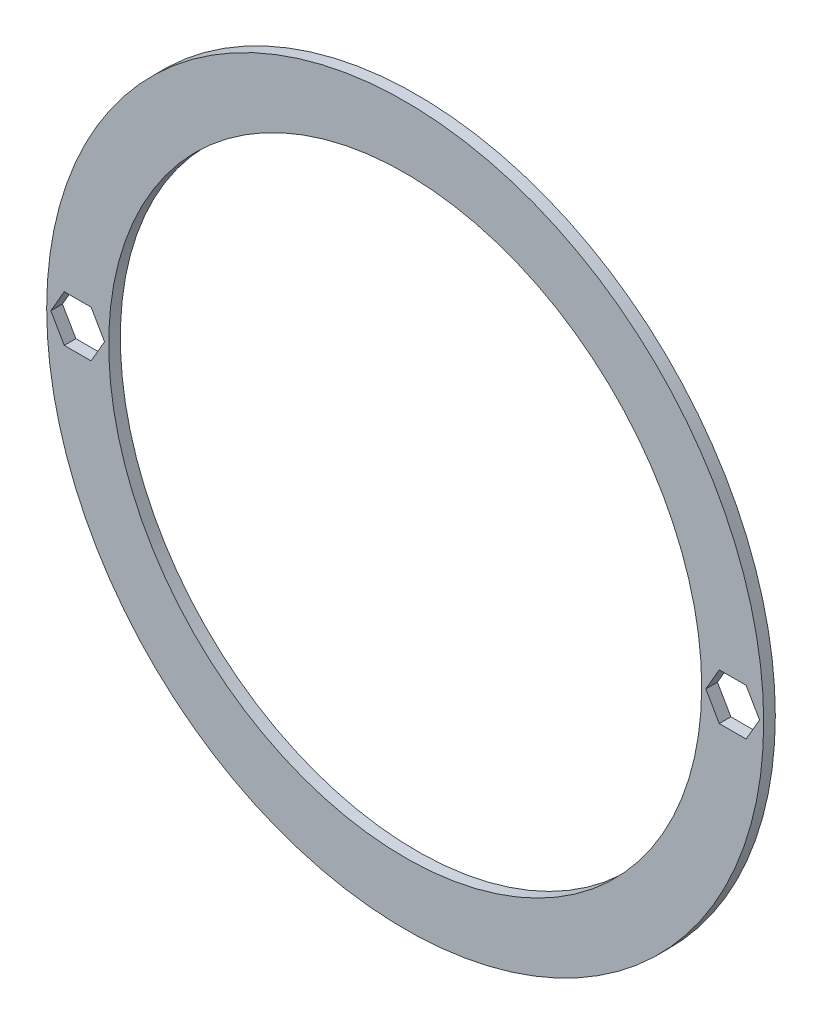
ISO-10303-21;
HEADER;
FILE_DESCRIPTION(('STEP AP214'),'2;1');
FILE_NAME('part.step','',(''),(''),'','','');
FILE_SCHEMA(('AUTOMOTIVE_DESIGN { 1 0 10303 214 1 1 1 1 }'));
ENDSEC;
DATA;
#1=APPLICATION_CONTEXT('core data for automotive mechanical design processes');
#2=APPLICATION_PROTOCOL_DEFINITION('international standard','automotive_design',2000,#1);
#3=PRODUCT_CONTEXT('',#1,'mechanical');
#4=PRODUCT('Part','Part','',(#3));
#5=PRODUCT_RELATED_PRODUCT_CATEGORY('part','',(#4));
#6=PRODUCT_DEFINITION_FORMATION('','',#4);
#7=PRODUCT_DEFINITION_CONTEXT('part definition',#1,'design');
#8=PRODUCT_DEFINITION('design','',#6,#7);
#9=PRODUCT_DEFINITION_SHAPE('','',#8);
#10=(LENGTH_UNIT() NAMED_UNIT(*) SI_UNIT(.MILLI.,.METRE.));
#11=(NAMED_UNIT(*) PLANE_ANGLE_UNIT() SI_UNIT($,.RADIAN.));
#12=(NAMED_UNIT(*) SI_UNIT($,.STERADIAN.) SOLID_ANGLE_UNIT());
#13=UNCERTAINTY_MEASURE_WITH_UNIT(LENGTH_MEASURE(1.E-05),#10,'distance_accuracy_value','');
#14=(GEOMETRIC_REPRESENTATION_CONTEXT(3) GLOBAL_UNCERTAINTY_ASSIGNED_CONTEXT((#13)) GLOBAL_UNIT_ASSIGNED_CONTEXT((#10,
#11,#12)) REPRESENTATION_CONTEXT('',''));
#15=CARTESIAN_POINT('',(0.,0.,0.));
#16=DIRECTION('',(0.,0.,1.));
#17=DIRECTION('',(1.,0.,0.));
#18=AXIS2_PLACEMENT_3D('',#15,#16,#17);
#19=CARTESIAN_POINT('',(0.,0.,1.5));
#20=DIRECTION('',(0.,0.,1.));
#21=DIRECTION('',(1.,0.,0.));
#22=AXIS2_PLACEMENT_3D('',#19,#20,#21);
#23=PLANE('',#22);
#24=CARTESIAN_POINT('',(0.,0.,1.5));
#25=DIRECTION('',(0.,0.,1.));
#26=DIRECTION('',(1.,0.,0.));
#27=AXIS2_PLACEMENT_3D('',#24,#25,#26);
#28=CIRCLE('',#27,46.25);
#29=CARTESIAN_POINT('',(46.25,0.,1.5));
#30=VERTEX_POINT('',#29);
#31=EDGE_CURVE('E11',#30,#30,#28,.T.);
#32=ORIENTED_EDGE('',*,*,#31,.T.);
#33=EDGE_LOOP('',(#32));
#34=FACE_BOUND('',#33,.T.);
#35=CARTESIAN_POINT('',(0.,0.,1.5));
#36=DIRECTION('',(0.,0.,1.));
#37=DIRECTION('',(1.,0.,0.));
#38=AXIS2_PLACEMENT_3D('',#35,#36,#37);
#39=CIRCLE('',#38,38.25);
#40=CARTESIAN_POINT('',(38.25,0.,1.5));
#41=VERTEX_POINT('',#40);
#42=EDGE_CURVE('E265',#41,#41,#39,.T.);
#43=ORIENTED_EDGE('',*,*,#42,.F.);
#44=EDGE_LOOP('',(#43));
#45=FACE_BOUND('',#44,.T.);
#46=DIRECTION('',(1.,0.,0.));
#47=VECTOR('',#46,1.);
#48=CARTESIAN_POINT('',(43.9820508075689,-3.,1.5));
#49=LINE('',#48,#47);
#50=CARTESIAN_POINT('',(40.5179491924311,-3.,1.5));
#51=VERTEX_POINT('',#50);
#52=CARTESIAN_POINT('',(43.9820508075689,-3.,1.5));
#53=VERTEX_POINT('',#52);
#54=EDGE_CURVE('E205',#51,#53,#49,.T.);
#55=ORIENTED_EDGE('',*,*,#54,.F.);
#56=DIRECTION('',(0.5,-0.866025403784439,0.));
#57=VECTOR('',#56,1.);
#58=CARTESIAN_POINT('',(40.5179491924311,-3.,1.5));
#59=LINE('',#58,#57);
#60=CARTESIAN_POINT('',(38.7858983848622,0.,1.5));
#61=VERTEX_POINT('',#60);
#62=EDGE_CURVE('E202',#61,#51,#59,.T.);
#63=ORIENTED_EDGE('',*,*,#62,.F.);
#64=DIRECTION('',(-0.500000000000001,-0.866025403784438,0.));
#65=VECTOR('',#64,1.);
#66=CARTESIAN_POINT('',(38.7858983848622,0.,1.5));
#67=LINE('',#66,#65);
#68=CARTESIAN_POINT('',(40.5179491924311,2.99999999999999,1.5));
#69=VERTEX_POINT('',#68);
#70=EDGE_CURVE('E219',#69,#61,#67,.T.);
#71=ORIENTED_EDGE('',*,*,#70,.F.);
#72=DIRECTION('',(-1.,0.,0.));
#73=VECTOR('',#72,1.);
#74=CARTESIAN_POINT('',(40.5179491924311,3.,1.5));
#75=LINE('',#74,#73);
#76=CARTESIAN_POINT('',(43.9820508075689,3.,1.5));
#77=VERTEX_POINT('',#76);
#78=EDGE_CURVE('E215',#77,#69,#75,.T.);
#79=ORIENTED_EDGE('',*,*,#78,.F.);
#80=DIRECTION('',(-0.5,0.866025403784439,0.));
#81=VECTOR('',#80,1.);
#82=CARTESIAN_POINT('',(43.9820508075689,3.,1.5));
#83=LINE('',#82,#81);
#84=CARTESIAN_POINT('',(45.7141016151377,0.,1.5));
#85=VERTEX_POINT('',#84);
#86=EDGE_CURVE('E212',#85,#77,#83,.T.);
#87=ORIENTED_EDGE('',*,*,#86,.F.);
#88=DIRECTION('',(0.5,0.866025403784439,0.));
#89=VECTOR('',#88,1.);
#90=CARTESIAN_POINT('',(45.7141016151377,0.,1.5));
#91=LINE('',#90,#89);
#92=EDGE_CURVE('E209',#53,#85,#91,.T.);
#93=ORIENTED_EDGE('',*,*,#92,.F.);
#94=EDGE_LOOP('',(#55,#63,#71,#79,#87,#93));
#95=FACE_BOUND('',#94,.T.);
#96=DIRECTION('',(-1.,0.,0.));
#97=VECTOR('',#96,1.);
#98=CARTESIAN_POINT('',(-40.5179491924311,3.,1.5));
#99=LINE('',#98,#97);
#100=CARTESIAN_POINT('',(-40.5179491924311,3.,1.5));
#101=VERTEX_POINT('',#100);
#102=CARTESIAN_POINT('',(-43.9820508075689,3.,1.5));
#103=VERTEX_POINT('',#102);
#104=EDGE_CURVE('E142',#101,#103,#99,.T.);
#105=ORIENTED_EDGE('',*,*,#104,.F.);
#106=DIRECTION('',(-0.500000000000001,0.866025403784438,0.));
#107=VECTOR('',#106,1.);
#108=CARTESIAN_POINT('',(-38.7858983848622,0.,1.5));
#109=LINE('',#108,#107);
#110=CARTESIAN_POINT('',(-38.7858983848622,0.,1.5));
#111=VERTEX_POINT('',#110);
#112=EDGE_CURVE('E133',#111,#101,#109,.T.);
#113=ORIENTED_EDGE('',*,*,#112,.F.);
#114=DIRECTION('',(0.5,0.866025403784439,0.));
#115=VECTOR('',#114,1.);
#116=CARTESIAN_POINT('',(-40.5179491924311,-3.,1.5));
#117=LINE('',#116,#115);
#118=CARTESIAN_POINT('',(-40.5179491924311,-3.,1.5));
#119=VERTEX_POINT('',#118);
#120=EDGE_CURVE('E168',#119,#111,#117,.T.);
#121=ORIENTED_EDGE('',*,*,#120,.F.);
#122=DIRECTION('',(1.,0.,0.));
#123=VECTOR('',#122,1.);
#124=CARTESIAN_POINT('',(-43.9820508075689,-3.,1.5));
#125=LINE('',#124,#123);
#126=CARTESIAN_POINT('',(-43.9820508075689,-3.,1.5));
#127=VERTEX_POINT('',#126);
#128=EDGE_CURVE('E165',#127,#119,#125,.T.);
#129=ORIENTED_EDGE('',*,*,#128,.F.);
#130=DIRECTION('',(0.5,-0.866025403784439,0.));
#131=VECTOR('',#130,1.);
#132=CARTESIAN_POINT('',(-45.7141016151377,0.,1.5));
#133=LINE('',#132,#131);
#134=CARTESIAN_POINT('',(-45.7141016151377,0.,1.5));
#135=VERTEX_POINT('',#134);
#136=EDGE_CURVE('E160',#135,#127,#133,.T.);
#137=ORIENTED_EDGE('',*,*,#136,.F.);
#138=DIRECTION('',(-0.5,-0.866025403784439,0.));
#139=VECTOR('',#138,1.);
#140=CARTESIAN_POINT('',(-43.9820508075689,3.,1.5));
#141=LINE('',#140,#139);
#142=EDGE_CURVE('E156',#103,#135,#141,.T.);
#143=ORIENTED_EDGE('',*,*,#142,.F.);
#144=EDGE_LOOP('',(#105,#113,#121,#129,#137,#143));
#145=FACE_BOUND('',#144,.T.);
#146=ADVANCED_FACE('F43',(#34,#45,#95,#145),#23,.T.);
#147=CARTESIAN_POINT('',(0.,0.,0.));
#148=DIRECTION('',(0.,0.,1.));
#149=DIRECTION('',(1.,0.,0.));
#150=AXIS2_PLACEMENT_3D('',#147,#148,#149);
#151=PLANE('',#150);
#152=DIRECTION('',(0.5,-0.866025403784439,0.));
#153=VECTOR('',#152,1.);
#154=CARTESIAN_POINT('',(40.5179491924311,-3.,0.));
#155=LINE('',#154,#153);
#156=CARTESIAN_POINT('',(38.7858983848623,0.,0.));
#157=VERTEX_POINT('',#156);
#158=CARTESIAN_POINT('',(40.5179491924311,-3.,0.));
#159=VERTEX_POINT('',#158);
#160=EDGE_CURVE('E151',#157,#159,#155,.T.);
#161=ORIENTED_EDGE('',*,*,#160,.T.);
#162=DIRECTION('',(1.,0.,0.));
#163=VECTOR('',#162,1.);
#164=CARTESIAN_POINT('',(43.9820508075689,-3.,0.));
#165=LINE('',#164,#163);
#166=CARTESIAN_POINT('',(43.9820508075689,-3.,0.));
#167=VERTEX_POINT('',#166);
#168=EDGE_CURVE('E226',#159,#167,#165,.T.);
#169=ORIENTED_EDGE('',*,*,#168,.T.);
#170=DIRECTION('',(0.5,0.866025403784439,0.));
#171=VECTOR('',#170,1.);
#172=CARTESIAN_POINT('',(45.7141016151377,0.,0.));
#173=LINE('',#172,#171);
#174=CARTESIAN_POINT('',(45.7141016151377,0.,0.));
#175=VERTEX_POINT('',#174);
#176=EDGE_CURVE('E230',#167,#175,#173,.T.);
#177=ORIENTED_EDGE('',*,*,#176,.T.);
#178=DIRECTION('',(-0.5,0.866025403784439,0.));
#179=VECTOR('',#178,1.);
#180=CARTESIAN_POINT('',(43.9820508075689,3.,0.));
#181=LINE('',#180,#179);
#182=CARTESIAN_POINT('',(43.9820508075689,3.,0.));
#183=VERTEX_POINT('',#182);
#184=EDGE_CURVE('E234',#175,#183,#181,.T.);
#185=ORIENTED_EDGE('',*,*,#184,.T.);
#186=DIRECTION('',(-1.,0.,0.));
#187=VECTOR('',#186,1.);
#188=CARTESIAN_POINT('',(40.5179491924311,3.,0.));
#189=LINE('',#188,#187);
#190=CARTESIAN_POINT('',(40.5179491924311,3.,0.));
#191=VERTEX_POINT('',#190);
#192=EDGE_CURVE('E238',#183,#191,#189,.T.);
#193=ORIENTED_EDGE('',*,*,#192,.T.);
#194=DIRECTION('',(-0.500000000000001,-0.866025403784438,0.));
#195=VECTOR('',#194,1.);
#196=CARTESIAN_POINT('',(38.7858983848622,0.,0.));
#197=LINE('',#196,#195);
#198=EDGE_CURVE('E206',#191,#157,#197,.T.);
#199=ORIENTED_EDGE('',*,*,#198,.T.);
#200=EDGE_LOOP('',(#161,#169,#177,#185,#193,#199));
#201=FACE_BOUND('',#200,.T.);
#202=CARTESIAN_POINT('',(0.,0.,0.));
#203=DIRECTION('',(0.,0.,1.));
#204=DIRECTION('',(1.,0.,0.));
#205=AXIS2_PLACEMENT_3D('',#202,#203,#204);
#206=CIRCLE('',#205,46.25);
#207=CARTESIAN_POINT('',(46.25,0.,0.));
#208=VERTEX_POINT('',#207);
#209=EDGE_CURVE('E47',#208,#208,#206,.T.);
#210=ORIENTED_EDGE('',*,*,#209,.F.);
#211=EDGE_LOOP('',(#210));
#212=FACE_BOUND('',#211,.T.);
#213=CARTESIAN_POINT('',(0.,0.,0.));
#214=DIRECTION('',(0.,0.,1.));
#215=DIRECTION('',(1.,0.,0.));
#216=AXIS2_PLACEMENT_3D('',#213,#214,#215);
#217=CIRCLE('',#216,38.25);
#218=CARTESIAN_POINT('',(38.25,0.,0.));
#219=VERTEX_POINT('',#218);
#220=EDGE_CURVE('E264',#219,#219,#217,.T.);
#221=ORIENTED_EDGE('',*,*,#220,.T.);
#222=EDGE_LOOP('',(#221));
#223=FACE_BOUND('',#222,.T.);
#224=DIRECTION('',(-0.500000000000001,0.866025403784438,0.));
#225=VECTOR('',#224,1.);
#226=CARTESIAN_POINT('',(-38.7858983848622,0.,0.));
#227=LINE('',#226,#225);
#228=CARTESIAN_POINT('',(-38.7858983848622,0.,0.));
#229=VERTEX_POINT('',#228);
#230=CARTESIAN_POINT('',(-40.5179491924311,3.,0.));
#231=VERTEX_POINT('',#230);
#232=EDGE_CURVE('E67',#229,#231,#227,.T.);
#233=ORIENTED_EDGE('',*,*,#232,.T.);
#234=DIRECTION('',(-1.,0.,0.));
#235=VECTOR('',#234,1.);
#236=CARTESIAN_POINT('',(-40.5179491924311,3.,0.));
#237=LINE('',#236,#235);
#238=CARTESIAN_POINT('',(-43.9820508075689,3.,0.));
#239=VERTEX_POINT('',#238);
#240=EDGE_CURVE('E149',#231,#239,#237,.T.);
#241=ORIENTED_EDGE('',*,*,#240,.T.);
#242=DIRECTION('',(-0.5,-0.866025403784439,0.));
#243=VECTOR('',#242,1.);
#244=CARTESIAN_POINT('',(-43.9820508075689,3.,0.));
#245=LINE('',#244,#243);
#246=CARTESIAN_POINT('',(-45.7141016151377,0.,0.));
#247=VERTEX_POINT('',#246);
#248=EDGE_CURVE('E175',#239,#247,#245,.T.);
#249=ORIENTED_EDGE('',*,*,#248,.T.);
#250=DIRECTION('',(0.5,-0.866025403784439,0.));
#251=VECTOR('',#250,1.);
#252=CARTESIAN_POINT('',(-45.7141016151377,0.,0.));
#253=LINE('',#252,#251);
#254=CARTESIAN_POINT('',(-43.9820508075689,-3.,0.));
#255=VERTEX_POINT('',#254);
#256=EDGE_CURVE('E179',#247,#255,#253,.T.);
#257=ORIENTED_EDGE('',*,*,#256,.T.);
#258=DIRECTION('',(1.,0.,0.));
#259=VECTOR('',#258,1.);
#260=CARTESIAN_POINT('',(-43.9820508075689,-3.,0.));
#261=LINE('',#260,#259);
#262=CARTESIAN_POINT('',(-40.5179491924311,-3.,0.));
#263=VERTEX_POINT('',#262);
#264=EDGE_CURVE('E183',#255,#263,#261,.T.);
#265=ORIENTED_EDGE('',*,*,#264,.T.);
#266=DIRECTION('',(0.5,0.866025403784439,0.));
#267=VECTOR('',#266,1.);
#268=CARTESIAN_POINT('',(-40.5179491924311,-3.,0.));
#269=LINE('',#268,#267);
#270=EDGE_CURVE('E143',#263,#229,#269,.T.);
#271=ORIENTED_EDGE('',*,*,#270,.T.);
#272=EDGE_LOOP('',(#233,#241,#249,#257,#265,#271));
#273=FACE_BOUND('',#272,.T.);
#274=ADVANCED_FACE('F273',(#201,#212,#223,#273),#151,.F.);
#275=CARTESIAN_POINT('',(0.,0.,1.5));
#276=DIRECTION('',(0.,0.,-1.));
#277=DIRECTION('',(-1.,0.,0.));
#278=AXIS2_PLACEMENT_3D('',#275,#276,#277);
#279=CYLINDRICAL_SURFACE('',#278,46.25);
#280=ORIENTED_EDGE('',*,*,#31,.F.);
#281=EDGE_LOOP('',(#280));
#282=FACE_BOUND('',#281,.T.);
#283=ORIENTED_EDGE('',*,*,#209,.T.);
#284=EDGE_LOOP('',(#283));
#285=FACE_BOUND('',#284,.T.);
#286=ADVANCED_FACE('F45',(#282,#285),#279,.T.);
#287=CARTESIAN_POINT('',(0.,0.,1.5));
#288=DIRECTION('',(0.,0.,-1.));
#289=DIRECTION('',(-1.,0.,0.));
#290=AXIS2_PLACEMENT_3D('',#287,#288,#289);
#291=CYLINDRICAL_SURFACE('',#290,38.25);
#292=ORIENTED_EDGE('',*,*,#42,.T.);
#293=EDGE_LOOP('',(#292));
#294=FACE_BOUND('',#293,.T.);
#295=ORIENTED_EDGE('',*,*,#220,.F.);
#296=EDGE_LOOP('',(#295));
#297=FACE_BOUND('',#296,.T.);
#298=ADVANCED_FACE('F276',(#294,#297),#291,.F.);
#299=CARTESIAN_POINT('',(40.5179491924311,-3.,1.5));
#300=DIRECTION('',(0.866025403784439,0.5,0.));
#301=DIRECTION('',(-0.5,0.866025403784439,0.));
#302=AXIS2_PLACEMENT_3D('',#299,#300,#301);
#303=PLANE('',#302);
#304=ORIENTED_EDGE('',*,*,#160,.F.);
#305=DIRECTION('',(0.,0.,-1.));
#306=VECTOR('',#305,1.);
#307=CARTESIAN_POINT('',(38.7858983848622,0.,1.5));
#308=LINE('',#307,#306);
#309=EDGE_CURVE('E222',#61,#157,#308,.T.);
#310=ORIENTED_EDGE('',*,*,#309,.F.);
#311=ORIENTED_EDGE('',*,*,#62,.T.);
#312=DIRECTION('',(0.,0.,-1.));
#313=VECTOR('',#312,1.);
#314=CARTESIAN_POINT('',(40.5179491924311,-3.,1.5));
#315=LINE('',#314,#313);
#316=EDGE_CURVE('E260',#51,#159,#315,.T.);
#317=ORIENTED_EDGE('',*,*,#316,.T.);
#318=EDGE_LOOP('',(#304,#310,#311,#317));
#319=FACE_BOUND('',#318,.T.);
#320=ADVANCED_FACE('F278',(#319),#303,.T.);
#321=CARTESIAN_POINT('',(43.9820508075689,-3.,1.5));
#322=DIRECTION('',(0.,1.,0.));
#323=DIRECTION('',(-1.,0.,0.));
#324=AXIS2_PLACEMENT_3D('',#321,#322,#323);
#325=PLANE('',#324);
#326=ORIENTED_EDGE('',*,*,#168,.F.);
#327=ORIENTED_EDGE('',*,*,#316,.F.);
#328=ORIENTED_EDGE('',*,*,#54,.T.);
#329=DIRECTION('',(0.,0.,-1.));
#330=VECTOR('',#329,1.);
#331=CARTESIAN_POINT('',(43.9820508075689,-3.,1.5));
#332=LINE('',#331,#330);
#333=EDGE_CURVE('E257',#53,#167,#332,.T.);
#334=ORIENTED_EDGE('',*,*,#333,.T.);
#335=EDGE_LOOP('',(#326,#327,#328,#334));
#336=FACE_BOUND('',#335,.T.);
#337=ADVANCED_FACE('F285',(#336),#325,.T.);
#338=CARTESIAN_POINT('',(45.7141016151377,0.,1.5));
#339=DIRECTION('',(-0.866025403784439,0.5,0.));
#340=DIRECTION('',(-0.5,-0.866025403784439,0.));
#341=AXIS2_PLACEMENT_3D('',#338,#339,#340);
#342=PLANE('',#341);
#343=ORIENTED_EDGE('',*,*,#176,.F.);
#344=ORIENTED_EDGE('',*,*,#333,.F.);
#345=ORIENTED_EDGE('',*,*,#92,.T.);
#346=DIRECTION('',(0.,0.,-1.));
#347=VECTOR('',#346,1.);
#348=CARTESIAN_POINT('',(45.7141016151377,0.,1.5));
#349=LINE('',#348,#347);
#350=EDGE_CURVE('E254',#85,#175,#349,.T.);
#351=ORIENTED_EDGE('',*,*,#350,.T.);
#352=EDGE_LOOP('',(#343,#344,#345,#351));
#353=FACE_BOUND('',#352,.T.);
#354=ADVANCED_FACE('F310',(#353),#342,.T.);
#355=CARTESIAN_POINT('',(43.9820508075689,3.,1.5));
#356=DIRECTION('',(-0.866025403784439,-0.5,0.));
#357=DIRECTION('',(0.5,-0.866025403784439,0.));
#358=AXIS2_PLACEMENT_3D('',#355,#356,#357);
#359=PLANE('',#358);
#360=ORIENTED_EDGE('',*,*,#184,.F.);
#361=ORIENTED_EDGE('',*,*,#350,.F.);
#362=ORIENTED_EDGE('',*,*,#86,.T.);
#363=DIRECTION('',(0.,0.,-1.));
#364=VECTOR('',#363,1.);
#365=CARTESIAN_POINT('',(43.9820508075689,3.,1.5));
#366=LINE('',#365,#364);
#367=EDGE_CURVE('E251',#77,#183,#366,.T.);
#368=ORIENTED_EDGE('',*,*,#367,.T.);
#369=EDGE_LOOP('',(#360,#361,#362,#368));
#370=FACE_BOUND('',#369,.T.);
#371=ADVANCED_FACE('F324',(#370),#359,.T.);
#372=CARTESIAN_POINT('',(40.5179491924311,3.,1.5));
#373=DIRECTION('',(0.,-1.,0.));
#374=DIRECTION('',(0.,0.,-1.));
#375=AXIS2_PLACEMENT_3D('',#372,#373,#374);
#376=PLANE('',#375);
#377=ORIENTED_EDGE('',*,*,#192,.F.);
#378=ORIENTED_EDGE('',*,*,#367,.F.);
#379=ORIENTED_EDGE('',*,*,#78,.T.);
#380=DIRECTION('',(0.,0.,-1.));
#381=VECTOR('',#380,1.);
#382=CARTESIAN_POINT('',(40.5179491924311,3.,1.5));
#383=LINE('',#382,#381);
#384=EDGE_CURVE('E248',#69,#191,#383,.T.);
#385=ORIENTED_EDGE('',*,*,#384,.T.);
#386=EDGE_LOOP('',(#377,#378,#379,#385));
#387=FACE_BOUND('',#386,.T.);
#388=ADVANCED_FACE('F321',(#387),#376,.T.);
#389=CARTESIAN_POINT('',(38.7858983848622,0.,1.5));
#390=DIRECTION('',(0.866025403784438,-0.500000000000001,0.));
#391=DIRECTION('',(0.500000000000001,0.866025403784438,0.));
#392=AXIS2_PLACEMENT_3D('',#389,#390,#391);
#393=PLANE('',#392);
#394=ORIENTED_EDGE('',*,*,#198,.F.);
#395=ORIENTED_EDGE('',*,*,#384,.F.);
#396=ORIENTED_EDGE('',*,*,#70,.T.);
#397=ORIENTED_EDGE('',*,*,#309,.T.);
#398=EDGE_LOOP('',(#394,#395,#396,#397));
#399=FACE_BOUND('',#398,.T.);
#400=ADVANCED_FACE('F317',(#399),#393,.T.);
#401=CARTESIAN_POINT('',(-38.7858983848622,0.,1.5));
#402=DIRECTION('',(-0.866025403784438,-0.500000000000001,0.));
#403=DIRECTION('',(0.500000000000001,-0.866025403784438,0.));
#404=AXIS2_PLACEMENT_3D('',#401,#402,#403);
#405=PLANE('',#404);
#406=ORIENTED_EDGE('',*,*,#232,.F.);
#407=DIRECTION('',(0.,0.,-1.));
#408=VECTOR('',#407,1.);
#409=CARTESIAN_POINT('',(-38.7858983848622,0.,1.5));
#410=LINE('',#409,#408);
#411=EDGE_CURVE('E137',#111,#229,#410,.T.);
#412=ORIENTED_EDGE('',*,*,#411,.F.);
#413=ORIENTED_EDGE('',*,*,#112,.T.);
#414=DIRECTION('',(0.,0.,-1.));
#415=VECTOR('',#414,1.);
#416=CARTESIAN_POINT('',(-40.5179491924311,3.,1.5));
#417=LINE('',#416,#415);
#418=EDGE_CURVE('E136',#101,#231,#417,.T.);
#419=ORIENTED_EDGE('',*,*,#418,.T.);
#420=EDGE_LOOP('',(#406,#412,#413,#419));
#421=FACE_BOUND('',#420,.T.);
#422=ADVANCED_FACE('F135',(#421),#405,.T.);
#423=CARTESIAN_POINT('',(-40.5179491924311,3.,1.5));
#424=DIRECTION('',(0.,-1.,0.));
#425=DIRECTION('',(0.,0.,-1.));
#426=AXIS2_PLACEMENT_3D('',#423,#424,#425);
#427=PLANE('',#426);
#428=ORIENTED_EDGE('',*,*,#240,.F.);
#429=ORIENTED_EDGE('',*,*,#418,.F.);
#430=ORIENTED_EDGE('',*,*,#104,.T.);
#431=DIRECTION('',(0.,0.,-1.));
#432=VECTOR('',#431,1.);
#433=CARTESIAN_POINT('',(-43.9820508075689,3.,1.5));
#434=LINE('',#433,#432);
#435=EDGE_CURVE('E152',#103,#239,#434,.T.);
#436=ORIENTED_EDGE('',*,*,#435,.T.);
#437=EDGE_LOOP('',(#428,#429,#430,#436));
#438=FACE_BOUND('',#437,.T.);
#439=ADVANCED_FACE('F146',(#438),#427,.T.);
#440=CARTESIAN_POINT('',(-43.9820508075689,3.,1.5));
#441=DIRECTION('',(0.866025403784439,-0.5,0.));
#442=DIRECTION('',(0.5,0.866025403784439,0.));
#443=AXIS2_PLACEMENT_3D('',#440,#441,#442);
#444=PLANE('',#443);
#445=ORIENTED_EDGE('',*,*,#248,.F.);
#446=ORIENTED_EDGE('',*,*,#435,.F.);
#447=ORIENTED_EDGE('',*,*,#142,.T.);
#448=DIRECTION('',(0.,0.,-1.));
#449=VECTOR('',#448,1.);
#450=CARTESIAN_POINT('',(-45.7141016151377,0.,1.5));
#451=LINE('',#450,#449);
#452=EDGE_CURVE('E197',#135,#247,#451,.T.);
#453=ORIENTED_EDGE('',*,*,#452,.T.);
#454=EDGE_LOOP('',(#445,#446,#447,#453));
#455=FACE_BOUND('',#454,.T.);
#456=ADVANCED_FACE('F383',(#455),#444,.T.);
#457=CARTESIAN_POINT('',(-45.7141016151377,0.,1.5));
#458=DIRECTION('',(0.866025403784439,0.5,0.));
#459=DIRECTION('',(-0.5,0.866025403784439,0.));
#460=AXIS2_PLACEMENT_3D('',#457,#458,#459);
#461=PLANE('',#460);
#462=ORIENTED_EDGE('',*,*,#256,.F.);
#463=ORIENTED_EDGE('',*,*,#452,.F.);
#464=ORIENTED_EDGE('',*,*,#136,.T.);
#465=DIRECTION('',(0.,0.,-1.));
#466=VECTOR('',#465,1.);
#467=CARTESIAN_POINT('',(-43.9820508075689,-3.,1.5));
#468=LINE('',#467,#466);
#469=EDGE_CURVE('E194',#127,#255,#468,.T.);
#470=ORIENTED_EDGE('',*,*,#469,.T.);
#471=EDGE_LOOP('',(#462,#463,#464,#470));
#472=FACE_BOUND('',#471,.T.);
#473=ADVANCED_FACE('F393',(#472),#461,.T.);
#474=CARTESIAN_POINT('',(-43.9820508075689,-3.,1.5));
#475=DIRECTION('',(0.,1.,0.));
#476=DIRECTION('',(-1.,0.,0.));
#477=AXIS2_PLACEMENT_3D('',#474,#475,#476);
#478=PLANE('',#477);
#479=ORIENTED_EDGE('',*,*,#264,.F.);
#480=ORIENTED_EDGE('',*,*,#469,.F.);
#481=ORIENTED_EDGE('',*,*,#128,.T.);
#482=DIRECTION('',(0.,0.,-1.));
#483=VECTOR('',#482,1.);
#484=CARTESIAN_POINT('',(-40.5179491924311,-3.,1.5));
#485=LINE('',#484,#483);
#486=EDGE_CURVE('E59',#119,#263,#485,.T.);
#487=ORIENTED_EDGE('',*,*,#486,.T.);
#488=EDGE_LOOP('',(#479,#480,#481,#487));
#489=FACE_BOUND('',#488,.T.);
#490=ADVANCED_FACE('F404',(#489),#478,.T.);
#491=CARTESIAN_POINT('',(-40.5179491924311,-3.,1.5));
#492=DIRECTION('',(-0.866025403784439,0.5,0.));
#493=DIRECTION('',(-0.5,-0.866025403784439,0.));
#494=AXIS2_PLACEMENT_3D('',#491,#492,#493);
#495=PLANE('',#494);
#496=ORIENTED_EDGE('',*,*,#270,.F.);
#497=ORIENTED_EDGE('',*,*,#486,.F.);
#498=ORIENTED_EDGE('',*,*,#120,.T.);
#499=ORIENTED_EDGE('',*,*,#411,.T.);
#500=EDGE_LOOP('',(#496,#497,#498,#499));
#501=FACE_BOUND('',#500,.T.);
#502=ADVANCED_FACE('F415',(#501),#495,.T.);
#503=CLOSED_SHELL('',(#146,#274,#286,#298,#320,#337,#354,#371,#388,#400,#422,#439,#456,#473,
#490,#502));
#504=MANIFOLD_SOLID_BREP('B2',#503);
#505=ADVANCED_BREP_SHAPE_REPRESENTATION('',(#18,#504),#14);
#506=SHAPE_DEFINITION_REPRESENTATION(#9,#505);
ENDSEC;
END-ISO-10303-21;
